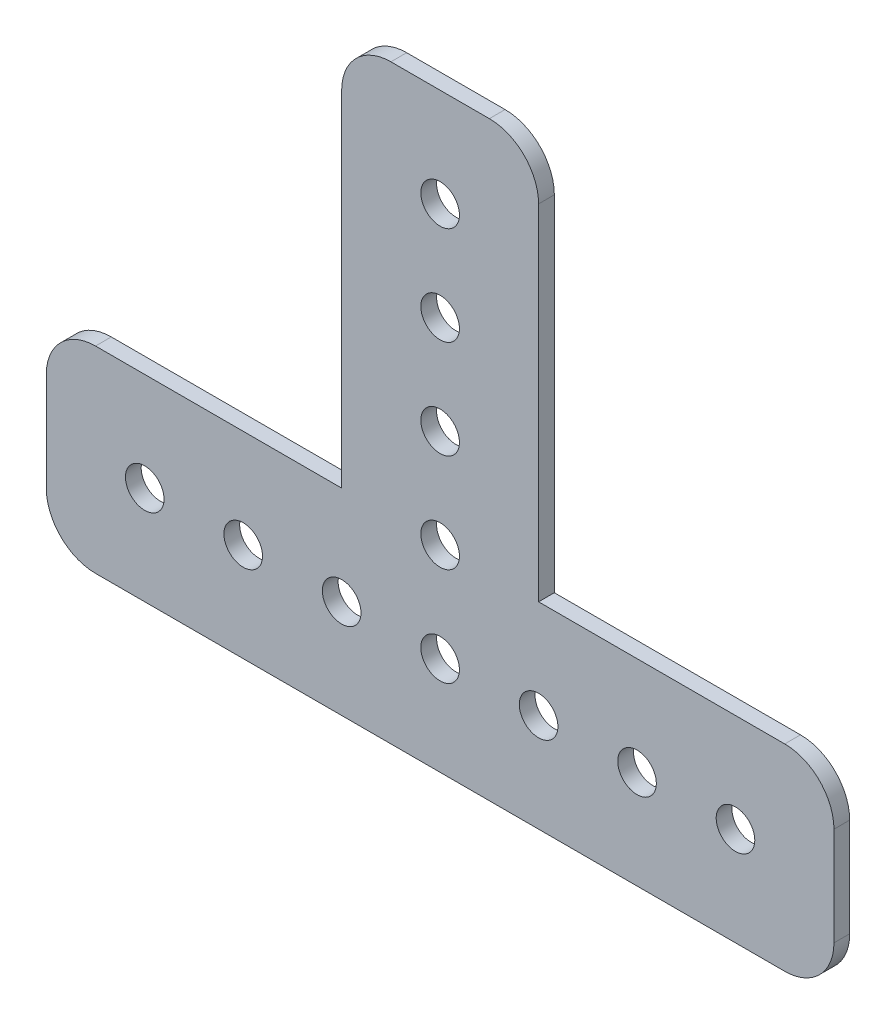
ISO-10303-21;
HEADER;
FILE_DESCRIPTION(('STEP AP214'),'2;1');
FILE_NAME('part.step','',(''),(''),'','','');
FILE_SCHEMA(('AUTOMOTIVE_DESIGN { 1 0 10303 214 1 1 1 1 }'));
ENDSEC;
DATA;
#1=APPLICATION_CONTEXT('core data for automotive mechanical design processes');
#2=APPLICATION_PROTOCOL_DEFINITION('international standard','automotive_design',2000,#1);
#3=PRODUCT_CONTEXT('',#1,'mechanical');
#4=PRODUCT('Part','Part','',(#3));
#5=PRODUCT_RELATED_PRODUCT_CATEGORY('part','',(#4));
#6=PRODUCT_DEFINITION_FORMATION('','',#4);
#7=PRODUCT_DEFINITION_CONTEXT('part definition',#1,'design');
#8=PRODUCT_DEFINITION('design','',#6,#7);
#9=PRODUCT_DEFINITION_SHAPE('','',#8);
#10=(LENGTH_UNIT() NAMED_UNIT(*) SI_UNIT(.MILLI.,.METRE.));
#11=(NAMED_UNIT(*) PLANE_ANGLE_UNIT() SI_UNIT($,.RADIAN.));
#12=(NAMED_UNIT(*) SI_UNIT($,.STERADIAN.) SOLID_ANGLE_UNIT());
#13=UNCERTAINTY_MEASURE_WITH_UNIT(LENGTH_MEASURE(1.E-05),#10,'distance_accuracy_value','');
#14=(GEOMETRIC_REPRESENTATION_CONTEXT(3) GLOBAL_UNCERTAINTY_ASSIGNED_CONTEXT((#13)) GLOBAL_UNIT_ASSIGNED_CONTEXT((#10,
#11,#12)) REPRESENTATION_CONTEXT('',''));
#15=CARTESIAN_POINT('',(0.,0.,0.));
#16=DIRECTION('',(0.,0.,1.));
#17=DIRECTION('',(1.,0.,0.));
#18=AXIS2_PLACEMENT_3D('',#15,#16,#17);
#19=CARTESIAN_POINT('',(50.8,27.2142857142857,0.));
#20=DIRECTION('',(0.,0.,1.));
#21=DIRECTION('',(1.,0.,0.));
#22=AXIS2_PLACEMENT_3D('',#19,#20,#21);
#23=PLANE('',#22);
#24=CARTESIAN_POINT('',(50.8,25.4,0.));
#25=DIRECTION('',(0.,0.,1.));
#26=DIRECTION('',(1.,0.,0.));
#27=AXIS2_PLACEMENT_3D('',#24,#25,#26);
#28=CIRCLE('',#27,2.4892);
#29=CARTESIAN_POINT('',(53.2892,25.4,0.));
#30=VERTEX_POINT('',#29);
#31=EDGE_CURVE('E222',#30,#30,#28,.T.);
#32=ORIENTED_EDGE('',*,*,#31,.T.);
#33=EDGE_LOOP('',(#32));
#34=FACE_BOUND('',#33,.T.);
#35=CARTESIAN_POINT('',(50.8,50.8,0.));
#36=DIRECTION('',(0.,0.,1.));
#37=DIRECTION('',(1.,0.,0.));
#38=AXIS2_PLACEMENT_3D('',#35,#36,#37);
#39=CIRCLE('',#38,2.4892);
#40=CARTESIAN_POINT('',(53.2892,50.8,0.));
#41=VERTEX_POINT('',#40);
#42=EDGE_CURVE('E225',#41,#41,#39,.T.);
#43=ORIENTED_EDGE('',*,*,#42,.T.);
#44=EDGE_LOOP('',(#43));
#45=FACE_BOUND('',#44,.T.);
#46=CARTESIAN_POINT('',(76.2,12.7,0.));
#47=DIRECTION('',(0.,0.,1.));
#48=DIRECTION('',(1.,0.,0.));
#49=AXIS2_PLACEMENT_3D('',#46,#47,#48);
#50=CIRCLE('',#49,2.4892);
#51=CARTESIAN_POINT('',(78.6892,12.7,0.));
#52=VERTEX_POINT('',#51);
#53=EDGE_CURVE('E228',#52,#52,#50,.T.);
#54=ORIENTED_EDGE('',*,*,#53,.T.);
#55=EDGE_LOOP('',(#54));
#56=FACE_BOUND('',#55,.T.);
#57=CARTESIAN_POINT('',(50.8,12.7,0.));
#58=DIRECTION('',(0.,0.,1.));
#59=DIRECTION('',(1.,0.,0.));
#60=AXIS2_PLACEMENT_3D('',#57,#58,#59);
#61=CIRCLE('',#60,2.4892);
#62=CARTESIAN_POINT('',(53.2892,12.7,0.));
#63=VERTEX_POINT('',#62);
#64=EDGE_CURVE('E231',#63,#63,#61,.T.);
#65=ORIENTED_EDGE('',*,*,#64,.T.);
#66=EDGE_LOOP('',(#65));
#67=FACE_BOUND('',#66,.T.);
#68=CARTESIAN_POINT('',(25.4,12.7,0.));
#69=DIRECTION('',(0.,0.,1.));
#70=DIRECTION('',(1.,0.,0.));
#71=AXIS2_PLACEMENT_3D('',#68,#69,#70);
#72=CIRCLE('',#71,2.4892);
#73=CARTESIAN_POINT('',(27.8892,12.7,0.));
#74=VERTEX_POINT('',#73);
#75=EDGE_CURVE('E234',#74,#74,#72,.T.);
#76=ORIENTED_EDGE('',*,*,#75,.T.);
#77=EDGE_LOOP('',(#76));
#78=FACE_BOUND('',#77,.T.);
#79=CARTESIAN_POINT('',(12.7,12.7,0.));
#80=DIRECTION('',(0.,0.,1.));
#81=DIRECTION('',(1.,0.,0.));
#82=AXIS2_PLACEMENT_3D('',#79,#80,#81);
#83=CIRCLE('',#82,2.4892);
#84=CARTESIAN_POINT('',(15.1892,12.7,0.));
#85=VERTEX_POINT('',#84);
#86=EDGE_CURVE('E237',#85,#85,#83,.T.);
#87=ORIENTED_EDGE('',*,*,#86,.T.);
#88=EDGE_LOOP('',(#87));
#89=FACE_BOUND('',#88,.T.);
#90=CARTESIAN_POINT('',(50.8,63.5,0.));
#91=DIRECTION('',(0.,0.,1.));
#92=DIRECTION('',(1.,0.,0.));
#93=AXIS2_PLACEMENT_3D('',#90,#91,#92);
#94=CIRCLE('',#93,2.4892);
#95=CARTESIAN_POINT('',(53.2892,63.5,0.));
#96=VERTEX_POINT('',#95);
#97=EDGE_CURVE('E240',#96,#96,#94,.T.);
#98=ORIENTED_EDGE('',*,*,#97,.T.);
#99=EDGE_LOOP('',(#98));
#100=FACE_BOUND('',#99,.T.);
#101=CARTESIAN_POINT('',(38.1,12.7,0.));
#102=DIRECTION('',(0.,0.,1.));
#103=DIRECTION('',(1.,0.,0.));
#104=AXIS2_PLACEMENT_3D('',#101,#102,#103);
#105=CIRCLE('',#104,2.4892);
#106=CARTESIAN_POINT('',(40.5892,12.7,0.));
#107=VERTEX_POINT('',#106);
#108=EDGE_CURVE('E243',#107,#107,#105,.T.);
#109=ORIENTED_EDGE('',*,*,#108,.T.);
#110=EDGE_LOOP('',(#109));
#111=FACE_BOUND('',#110,.T.);
#112=CARTESIAN_POINT('',(63.5,12.7,0.));
#113=DIRECTION('',(0.,0.,1.));
#114=DIRECTION('',(1.,0.,0.));
#115=AXIS2_PLACEMENT_3D('',#112,#113,#114);
#116=CIRCLE('',#115,2.4892);
#117=CARTESIAN_POINT('',(65.9892,12.7,0.));
#118=VERTEX_POINT('',#117);
#119=EDGE_CURVE('E246',#118,#118,#116,.T.);
#120=ORIENTED_EDGE('',*,*,#119,.T.);
#121=EDGE_LOOP('',(#120));
#122=FACE_BOUND('',#121,.T.);
#123=CARTESIAN_POINT('',(88.9,12.7,0.));
#124=DIRECTION('',(0.,0.,1.));
#125=DIRECTION('',(1.,0.,0.));
#126=AXIS2_PLACEMENT_3D('',#123,#124,#125);
#127=CIRCLE('',#126,2.4892);
#128=CARTESIAN_POINT('',(91.3892,12.7,0.));
#129=VERTEX_POINT('',#128);
#130=EDGE_CURVE('E129',#129,#129,#127,.T.);
#131=ORIENTED_EDGE('',*,*,#130,.T.);
#132=EDGE_LOOP('',(#131));
#133=FACE_BOUND('',#132,.T.);
#134=CARTESIAN_POINT('',(50.8,38.1,0.));
#135=DIRECTION('',(0.,0.,1.));
#136=DIRECTION('',(1.,0.,0.));
#137=AXIS2_PLACEMENT_3D('',#134,#135,#136);
#138=CIRCLE('',#137,2.4892);
#139=CARTESIAN_POINT('',(53.2892,38.1,0.));
#140=VERTEX_POINT('',#139);
#141=EDGE_CURVE('E126',#140,#140,#138,.T.);
#142=ORIENTED_EDGE('',*,*,#141,.T.);
#143=EDGE_LOOP('',(#142));
#144=FACE_BOUND('',#143,.T.);
#145=DIRECTION('',(1.,0.,0.));
#146=VECTOR('',#145,1.);
#147=CARTESIAN_POINT('',(0.,0.,0.));
#148=LINE('',#147,#146);
#149=CARTESIAN_POINT('',(6.35,0.,0.));
#150=VERTEX_POINT('',#149);
#151=CARTESIAN_POINT('',(95.25,0.,0.));
#152=VERTEX_POINT('',#151);
#153=EDGE_CURVE('E110',#150,#152,#148,.T.);
#154=ORIENTED_EDGE('',*,*,#153,.F.);
#155=CARTESIAN_POINT('',(6.35,6.35,0.));
#156=DIRECTION('',(0.,0.,1.));
#157=DIRECTION('',(1.,0.,0.));
#158=AXIS2_PLACEMENT_3D('',#155,#156,#157);
#159=CIRCLE('',#158,6.35);
#160=CARTESIAN_POINT('',(0.,6.35,0.));
#161=VERTEX_POINT('',#160);
#162=EDGE_CURVE('E123',#161,#150,#159,.T.);
#163=ORIENTED_EDGE('',*,*,#162,.F.);
#164=DIRECTION('',(0.,1.,0.));
#165=VECTOR('',#164,1.);
#166=CARTESIAN_POINT('',(0.,25.4,0.));
#167=LINE('',#166,#165);
#168=CARTESIAN_POINT('',(0.,19.05,0.));
#169=VERTEX_POINT('',#168);
#170=EDGE_CURVE('E135',#169,#161,#167,.F.);
#171=ORIENTED_EDGE('',*,*,#170,.F.);
#172=CARTESIAN_POINT('',(6.35,19.05,0.));
#173=DIRECTION('',(0.,0.,1.));
#174=DIRECTION('',(1.,0.,0.));
#175=AXIS2_PLACEMENT_3D('',#172,#173,#174);
#176=CIRCLE('',#175,6.35);
#177=CARTESIAN_POINT('',(6.35,25.4,0.));
#178=VERTEX_POINT('',#177);
#179=EDGE_CURVE('E252',#178,#169,#176,.T.);
#180=ORIENTED_EDGE('',*,*,#179,.F.);
#181=DIRECTION('',(1.,0.,0.));
#182=VECTOR('',#181,1.);
#183=CARTESIAN_POINT('',(38.1,25.4,0.));
#184=LINE('',#183,#182);
#185=CARTESIAN_POINT('',(38.1,25.4,0.));
#186=VERTEX_POINT('',#185);
#187=EDGE_CURVE('E139',#186,#178,#184,.F.);
#188=ORIENTED_EDGE('',*,*,#187,.F.);
#189=DIRECTION('',(0.,-1.,0.));
#190=VECTOR('',#189,1.);
#191=CARTESIAN_POINT('',(38.1,76.2,0.));
#192=LINE('',#191,#190);
#193=CARTESIAN_POINT('',(38.1,69.85,0.));
#194=VERTEX_POINT('',#193);
#195=EDGE_CURVE('E145',#194,#186,#192,.T.);
#196=ORIENTED_EDGE('',*,*,#195,.F.);
#197=CARTESIAN_POINT('',(44.45,69.85,0.));
#198=DIRECTION('',(0.,0.,1.));
#199=DIRECTION('',(1.,0.,0.));
#200=AXIS2_PLACEMENT_3D('',#197,#198,#199);
#201=CIRCLE('',#200,6.35);
#202=CARTESIAN_POINT('',(44.45,76.2,0.));
#203=VERTEX_POINT('',#202);
#204=EDGE_CURVE('E254',#203,#194,#201,.T.);
#205=ORIENTED_EDGE('',*,*,#204,.F.);
#206=DIRECTION('',(1.,0.,0.));
#207=VECTOR('',#206,1.);
#208=CARTESIAN_POINT('',(63.5,76.2,0.));
#209=LINE('',#208,#207);
#210=CARTESIAN_POINT('',(57.15,76.2,0.));
#211=VERTEX_POINT('',#210);
#212=EDGE_CURVE('E151',#211,#203,#209,.F.);
#213=ORIENTED_EDGE('',*,*,#212,.F.);
#214=CARTESIAN_POINT('',(57.15,69.85,0.));
#215=DIRECTION('',(0.,0.,1.));
#216=DIRECTION('',(1.,0.,0.));
#217=AXIS2_PLACEMENT_3D('',#214,#215,#216);
#218=CIRCLE('',#217,6.35);
#219=CARTESIAN_POINT('',(63.5,69.85,0.));
#220=VERTEX_POINT('',#219);
#221=EDGE_CURVE('E256',#220,#211,#218,.T.);
#222=ORIENTED_EDGE('',*,*,#221,.F.);
#223=DIRECTION('',(0.,1.,0.));
#224=VECTOR('',#223,1.);
#225=CARTESIAN_POINT('',(63.5,25.4,0.));
#226=LINE('',#225,#224);
#227=CARTESIAN_POINT('',(63.5,25.4,0.));
#228=VERTEX_POINT('',#227);
#229=EDGE_CURVE('E155',#228,#220,#226,.T.);
#230=ORIENTED_EDGE('',*,*,#229,.F.);
#231=DIRECTION('',(-1.,0.,0.));
#232=VECTOR('',#231,1.);
#233=CARTESIAN_POINT('',(101.6,25.4,0.));
#234=LINE('',#233,#232);
#235=CARTESIAN_POINT('',(95.25,25.4,0.));
#236=VERTEX_POINT('',#235);
#237=EDGE_CURVE('E161',#236,#228,#234,.T.);
#238=ORIENTED_EDGE('',*,*,#237,.F.);
#239=CARTESIAN_POINT('',(95.25,19.05,0.));
#240=DIRECTION('',(0.,0.,1.));
#241=DIRECTION('',(1.,0.,0.));
#242=AXIS2_PLACEMENT_3D('',#239,#240,#241);
#243=CIRCLE('',#242,6.35);
#244=CARTESIAN_POINT('',(101.6,19.05,0.));
#245=VERTEX_POINT('',#244);
#246=EDGE_CURVE('E257',#245,#236,#243,.T.);
#247=ORIENTED_EDGE('',*,*,#246,.F.);
#248=DIRECTION('',(0.,1.,0.));
#249=VECTOR('',#248,1.);
#250=CARTESIAN_POINT('',(101.6,0.,0.));
#251=LINE('',#250,#249);
#252=CARTESIAN_POINT('',(101.6,6.35,0.));
#253=VERTEX_POINT('',#252);
#254=EDGE_CURVE('E112',#253,#245,#251,.T.);
#255=ORIENTED_EDGE('',*,*,#254,.F.);
#256=CARTESIAN_POINT('',(95.25,6.35,0.));
#257=DIRECTION('',(0.,0.,1.));
#258=DIRECTION('',(1.,0.,0.));
#259=AXIS2_PLACEMENT_3D('',#256,#257,#258);
#260=CIRCLE('',#259,6.35);
#261=EDGE_CURVE('E18',#152,#253,#260,.T.);
#262=ORIENTED_EDGE('',*,*,#261,.F.);
#263=EDGE_LOOP('',(#154,#163,#171,#180,#188,#196,#205,#213,#222,#230,#238,#247,#255,#262));
#264=FACE_BOUND('',#263,.T.);
#265=ADVANCED_FACE('F15',(#34,#45,#56,#67,#78,#89,#100,#111,#122,#133,#144,#264),#23,.F.);
#266=CARTESIAN_POINT('',(95.25,6.35,0.));
#267=DIRECTION('',(0.,0.,1.));
#268=DIRECTION('',(1.,0.,0.));
#269=AXIS2_PLACEMENT_3D('',#266,#267,#268);
#270=CYLINDRICAL_SURFACE('',#269,6.35);
#271=ORIENTED_EDGE('',*,*,#261,.T.);
#272=DIRECTION('',(0.,0.,-1.));
#273=VECTOR('',#272,1.);
#274=CARTESIAN_POINT('',(101.6,6.35,0.));
#275=LINE('',#274,#273);
#276=CARTESIAN_POINT('',(101.6,6.35,2.032));
#277=VERTEX_POINT('',#276);
#278=EDGE_CURVE('E115',#277,#253,#275,.T.);
#279=ORIENTED_EDGE('',*,*,#278,.F.);
#280=CARTESIAN_POINT('',(95.25,6.35,2.032));
#281=DIRECTION('',(0.,0.,1.));
#282=DIRECTION('',(1.,0.,0.));
#283=AXIS2_PLACEMENT_3D('',#280,#281,#282);
#284=CIRCLE('',#283,6.35);
#285=CARTESIAN_POINT('',(95.25,0.,2.032));
#286=VERTEX_POINT('',#285);
#287=EDGE_CURVE('E120',#286,#277,#284,.T.);
#288=ORIENTED_EDGE('',*,*,#287,.F.);
#289=DIRECTION('',(0.,0.,1.));
#290=VECTOR('',#289,1.);
#291=CARTESIAN_POINT('',(95.25,0.,0.));
#292=LINE('',#291,#290);
#293=EDGE_CURVE('E117',#152,#286,#292,.T.);
#294=ORIENTED_EDGE('',*,*,#293,.F.);
#295=EDGE_LOOP('',(#271,#279,#288,#294));
#296=FACE_BOUND('',#295,.T.);
#297=ADVANCED_FACE('F118',(#296),#270,.T.);
#298=CARTESIAN_POINT('',(101.6,0.,0.));
#299=DIRECTION('',(1.,0.,0.));
#300=DIRECTION('',(0.,0.,-1.));
#301=AXIS2_PLACEMENT_3D('',#298,#299,#300);
#302=PLANE('',#301);
#303=DIRECTION('',(0.,0.,1.));
#304=VECTOR('',#303,1.);
#305=CARTESIAN_POINT('',(101.6,19.05,0.));
#306=LINE('',#305,#304);
#307=CARTESIAN_POINT('',(101.6,19.05,2.032));
#308=VERTEX_POINT('',#307);
#309=EDGE_CURVE('E167',#308,#245,#306,.F.);
#310=ORIENTED_EDGE('',*,*,#309,.F.);
#311=DIRECTION('',(0.,1.,0.));
#312=VECTOR('',#311,1.);
#313=CARTESIAN_POINT('',(101.6,27.2142857142857,2.032));
#314=LINE('',#313,#312);
#315=EDGE_CURVE('E220',#277,#308,#314,.T.);
#316=ORIENTED_EDGE('',*,*,#315,.F.);
#317=ORIENTED_EDGE('',*,*,#278,.T.);
#318=ORIENTED_EDGE('',*,*,#254,.T.);
#319=EDGE_LOOP('',(#310,#316,#317,#318));
#320=FACE_BOUND('',#319,.T.);
#321=ADVANCED_FACE('F346',(#320),#302,.T.);
#322=CARTESIAN_POINT('',(95.25,19.05,0.));
#323=DIRECTION('',(0.,0.,1.));
#324=DIRECTION('',(1.,0.,0.));
#325=AXIS2_PLACEMENT_3D('',#322,#323,#324);
#326=CYLINDRICAL_SURFACE('',#325,6.35);
#327=ORIENTED_EDGE('',*,*,#246,.T.);
#328=DIRECTION('',(0.,0.,1.));
#329=VECTOR('',#328,1.);
#330=CARTESIAN_POINT('',(95.25,25.4,0.));
#331=LINE('',#330,#329);
#332=CARTESIAN_POINT('',(95.25,25.4,2.032));
#333=VERTEX_POINT('',#332);
#334=EDGE_CURVE('E164',#333,#236,#331,.F.);
#335=ORIENTED_EDGE('',*,*,#334,.F.);
#336=CARTESIAN_POINT('',(95.25,19.05,2.032));
#337=DIRECTION('',(0.,0.,1.));
#338=DIRECTION('',(1.,0.,0.));
#339=AXIS2_PLACEMENT_3D('',#336,#337,#338);
#340=CIRCLE('',#339,6.35);
#341=EDGE_CURVE('E216',#308,#333,#340,.T.);
#342=ORIENTED_EDGE('',*,*,#341,.F.);
#343=ORIENTED_EDGE('',*,*,#309,.T.);
#344=EDGE_LOOP('',(#327,#335,#342,#343));
#345=FACE_BOUND('',#344,.T.);
#346=ADVANCED_FACE('F344',(#345),#326,.T.);
#347=CARTESIAN_POINT('',(101.6,25.4,0.));
#348=DIRECTION('',(0.,1.,0.));
#349=DIRECTION('',(-1.,0.,0.));
#350=AXIS2_PLACEMENT_3D('',#347,#348,#349);
#351=PLANE('',#350);
#352=DIRECTION('',(0.,0.,-1.));
#353=VECTOR('',#352,1.);
#354=CARTESIAN_POINT('',(63.5,25.4,0.));
#355=LINE('',#354,#353);
#356=CARTESIAN_POINT('',(63.5,25.4,2.032));
#357=VERTEX_POINT('',#356);
#358=EDGE_CURVE('E158',#357,#228,#355,.T.);
#359=ORIENTED_EDGE('',*,*,#358,.F.);
#360=DIRECTION('',(1.,0.,0.));
#361=VECTOR('',#360,1.);
#362=CARTESIAN_POINT('',(50.8,25.4,2.032));
#363=LINE('',#362,#361);
#364=EDGE_CURVE('E219',#333,#357,#363,.F.);
#365=ORIENTED_EDGE('',*,*,#364,.F.);
#366=ORIENTED_EDGE('',*,*,#334,.T.);
#367=ORIENTED_EDGE('',*,*,#237,.T.);
#368=EDGE_LOOP('',(#359,#365,#366,#367));
#369=FACE_BOUND('',#368,.T.);
#370=ADVANCED_FACE('F335',(#369),#351,.T.);
#371=CARTESIAN_POINT('',(63.5,25.4,0.));
#372=DIRECTION('',(1.,0.,0.));
#373=DIRECTION('',(0.,0.,-1.));
#374=AXIS2_PLACEMENT_3D('',#371,#372,#373);
#375=PLANE('',#374);
#376=ORIENTED_EDGE('',*,*,#358,.T.);
#377=ORIENTED_EDGE('',*,*,#229,.T.);
#378=DIRECTION('',(0.,0.,1.));
#379=VECTOR('',#378,1.);
#380=CARTESIAN_POINT('',(63.5,69.85,0.));
#381=LINE('',#380,#379);
#382=CARTESIAN_POINT('',(63.5,69.85,2.032));
#383=VERTEX_POINT('',#382);
#384=EDGE_CURVE('E157',#383,#220,#381,.F.);
#385=ORIENTED_EDGE('',*,*,#384,.F.);
#386=DIRECTION('',(0.,1.,0.));
#387=VECTOR('',#386,1.);
#388=CARTESIAN_POINT('',(63.5,27.2142857142857,2.032));
#389=LINE('',#388,#387);
#390=EDGE_CURVE('E215',#357,#383,#389,.T.);
#391=ORIENTED_EDGE('',*,*,#390,.F.);
#392=EDGE_LOOP('',(#376,#377,#385,#391));
#393=FACE_BOUND('',#392,.T.);
#394=ADVANCED_FACE('F341',(#393),#375,.T.);
#395=CARTESIAN_POINT('',(57.15,69.85,0.));
#396=DIRECTION('',(0.,0.,1.));
#397=DIRECTION('',(1.,0.,0.));
#398=AXIS2_PLACEMENT_3D('',#395,#396,#397);
#399=CYLINDRICAL_SURFACE('',#398,6.35);
#400=ORIENTED_EDGE('',*,*,#221,.T.);
#401=DIRECTION('',(0.,0.,1.));
#402=VECTOR('',#401,1.);
#403=CARTESIAN_POINT('',(57.15,76.2,0.));
#404=LINE('',#403,#402);
#405=CARTESIAN_POINT('',(57.15,76.2,2.032));
#406=VERTEX_POINT('',#405);
#407=EDGE_CURVE('E154',#406,#211,#404,.F.);
#408=ORIENTED_EDGE('',*,*,#407,.F.);
#409=CARTESIAN_POINT('',(57.15,69.85,2.032));
#410=DIRECTION('',(0.,0.,1.));
#411=DIRECTION('',(1.,0.,0.));
#412=AXIS2_PLACEMENT_3D('',#409,#410,#411);
#413=CIRCLE('',#412,6.35);
#414=EDGE_CURVE('E212',#383,#406,#413,.T.);
#415=ORIENTED_EDGE('',*,*,#414,.F.);
#416=ORIENTED_EDGE('',*,*,#384,.T.);
#417=EDGE_LOOP('',(#400,#408,#415,#416));
#418=FACE_BOUND('',#417,.T.);
#419=ADVANCED_FACE('F426',(#418),#399,.T.);
#420=CARTESIAN_POINT('',(63.5,76.2,0.));
#421=DIRECTION('',(0.,1.,0.));
#422=DIRECTION('',(0.,0.,1.));
#423=AXIS2_PLACEMENT_3D('',#420,#421,#422);
#424=PLANE('',#423);
#425=DIRECTION('',(0.,0.,1.));
#426=VECTOR('',#425,1.);
#427=CARTESIAN_POINT('',(44.45,76.2,0.));
#428=LINE('',#427,#426);
#429=CARTESIAN_POINT('',(44.45,76.2,2.032));
#430=VERTEX_POINT('',#429);
#431=EDGE_CURVE('E153',#430,#203,#428,.F.);
#432=ORIENTED_EDGE('',*,*,#431,.F.);
#433=DIRECTION('',(1.,0.,0.));
#434=VECTOR('',#433,1.);
#435=CARTESIAN_POINT('',(50.8,76.2,2.032));
#436=LINE('',#435,#434);
#437=EDGE_CURVE('E211',#406,#430,#436,.F.);
#438=ORIENTED_EDGE('',*,*,#437,.F.);
#439=ORIENTED_EDGE('',*,*,#407,.T.);
#440=ORIENTED_EDGE('',*,*,#212,.T.);
#441=EDGE_LOOP('',(#432,#438,#439,#440));
#442=FACE_BOUND('',#441,.T.);
#443=ADVANCED_FACE('F422',(#442),#424,.T.);
#444=CARTESIAN_POINT('',(44.45,69.85,0.));
#445=DIRECTION('',(0.,0.,1.));
#446=DIRECTION('',(1.,0.,0.));
#447=AXIS2_PLACEMENT_3D('',#444,#445,#446);
#448=CYLINDRICAL_SURFACE('',#447,6.35);
#449=ORIENTED_EDGE('',*,*,#204,.T.);
#450=DIRECTION('',(0.,0.,1.));
#451=VECTOR('',#450,1.);
#452=CARTESIAN_POINT('',(38.1,69.85,0.));
#453=LINE('',#452,#451);
#454=CARTESIAN_POINT('',(38.1,69.85,2.032));
#455=VERTEX_POINT('',#454);
#456=EDGE_CURVE('E148',#455,#194,#453,.F.);
#457=ORIENTED_EDGE('',*,*,#456,.F.);
#458=CARTESIAN_POINT('',(44.45,69.85,2.032));
#459=DIRECTION('',(0.,0.,1.));
#460=DIRECTION('',(1.,0.,0.));
#461=AXIS2_PLACEMENT_3D('',#458,#459,#460);
#462=CIRCLE('',#461,6.35);
#463=EDGE_CURVE('E207',#430,#455,#462,.T.);
#464=ORIENTED_EDGE('',*,*,#463,.F.);
#465=ORIENTED_EDGE('',*,*,#431,.T.);
#466=EDGE_LOOP('',(#449,#457,#464,#465));
#467=FACE_BOUND('',#466,.T.);
#468=ADVANCED_FACE('F419',(#467),#448,.T.);
#469=CARTESIAN_POINT('',(38.1,76.2,0.));
#470=DIRECTION('',(-1.,0.,0.));
#471=DIRECTION('',(0.,-1.,0.));
#472=AXIS2_PLACEMENT_3D('',#469,#470,#471);
#473=PLANE('',#472);
#474=DIRECTION('',(0.,0.,1.));
#475=VECTOR('',#474,1.);
#476=CARTESIAN_POINT('',(38.1,25.4,0.));
#477=LINE('',#476,#475);
#478=CARTESIAN_POINT('',(38.1,25.4,2.032));
#479=VERTEX_POINT('',#478);
#480=EDGE_CURVE('E142',#479,#186,#477,.F.);
#481=ORIENTED_EDGE('',*,*,#480,.F.);
#482=DIRECTION('',(0.,1.,0.));
#483=VECTOR('',#482,1.);
#484=CARTESIAN_POINT('',(38.1,27.2142857142857,2.032));
#485=LINE('',#484,#483);
#486=EDGE_CURVE('E210',#455,#479,#485,.F.);
#487=ORIENTED_EDGE('',*,*,#486,.F.);
#488=ORIENTED_EDGE('',*,*,#456,.T.);
#489=ORIENTED_EDGE('',*,*,#195,.T.);
#490=EDGE_LOOP('',(#481,#487,#488,#489));
#491=FACE_BOUND('',#490,.T.);
#492=ADVANCED_FACE('F329',(#491),#473,.T.);
#493=CARTESIAN_POINT('',(38.1,25.4,0.));
#494=DIRECTION('',(0.,1.,0.));
#495=DIRECTION('',(0.,0.,1.));
#496=AXIS2_PLACEMENT_3D('',#493,#494,#495);
#497=PLANE('',#496);
#498=ORIENTED_EDGE('',*,*,#480,.T.);
#499=ORIENTED_EDGE('',*,*,#187,.T.);
#500=DIRECTION('',(0.,0.,1.));
#501=VECTOR('',#500,1.);
#502=CARTESIAN_POINT('',(6.35,25.4,0.));
#503=LINE('',#502,#501);
#504=CARTESIAN_POINT('',(6.35,25.4,2.032));
#505=VERTEX_POINT('',#504);
#506=EDGE_CURVE('E141',#505,#178,#503,.F.);
#507=ORIENTED_EDGE('',*,*,#506,.F.);
#508=DIRECTION('',(1.,0.,0.));
#509=VECTOR('',#508,1.);
#510=CARTESIAN_POINT('',(50.8,25.4,2.032));
#511=LINE('',#510,#509);
#512=EDGE_CURVE('E206',#479,#505,#511,.F.);
#513=ORIENTED_EDGE('',*,*,#512,.F.);
#514=EDGE_LOOP('',(#498,#499,#507,#513));
#515=FACE_BOUND('',#514,.T.);
#516=ADVANCED_FACE('F324',(#515),#497,.T.);
#517=CARTESIAN_POINT('',(6.35,19.05,0.));
#518=DIRECTION('',(0.,0.,1.));
#519=DIRECTION('',(1.,0.,0.));
#520=AXIS2_PLACEMENT_3D('',#517,#518,#519);
#521=CYLINDRICAL_SURFACE('',#520,6.35);
#522=ORIENTED_EDGE('',*,*,#179,.T.);
#523=DIRECTION('',(0.,0.,1.));
#524=VECTOR('',#523,1.);
#525=CARTESIAN_POINT('',(0.,19.05,0.));
#526=LINE('',#525,#524);
#527=CARTESIAN_POINT('',(0.,19.05,2.032));
#528=VERTEX_POINT('',#527);
#529=EDGE_CURVE('E138',#528,#169,#526,.F.);
#530=ORIENTED_EDGE('',*,*,#529,.F.);
#531=CARTESIAN_POINT('',(6.35,19.05,2.032));
#532=DIRECTION('',(0.,0.,1.));
#533=DIRECTION('',(1.,0.,0.));
#534=AXIS2_PLACEMENT_3D('',#531,#532,#533);
#535=CIRCLE('',#534,6.35);
#536=EDGE_CURVE('E203',#505,#528,#535,.T.);
#537=ORIENTED_EDGE('',*,*,#536,.F.);
#538=ORIENTED_EDGE('',*,*,#506,.T.);
#539=EDGE_LOOP('',(#522,#530,#537,#538));
#540=FACE_BOUND('',#539,.T.);
#541=ADVANCED_FACE('F321',(#540),#521,.T.);
#542=CARTESIAN_POINT('',(0.,25.4,0.));
#543=DIRECTION('',(-1.,0.,0.));
#544=DIRECTION('',(0.,0.,1.));
#545=AXIS2_PLACEMENT_3D('',#542,#543,#544);
#546=PLANE('',#545);
#547=ORIENTED_EDGE('',*,*,#529,.T.);
#548=ORIENTED_EDGE('',*,*,#170,.T.);
#549=DIRECTION('',(0.,0.,1.));
#550=VECTOR('',#549,1.);
#551=CARTESIAN_POINT('',(0.,6.35,0.));
#552=LINE('',#551,#550);
#553=CARTESIAN_POINT('',(0.,6.35,2.032));
#554=VERTEX_POINT('',#553);
#555=EDGE_CURVE('E137',#554,#161,#552,.F.);
#556=ORIENTED_EDGE('',*,*,#555,.F.);
#557=DIRECTION('',(0.,1.,0.));
#558=VECTOR('',#557,1.);
#559=CARTESIAN_POINT('',(0.,27.2142857142857,2.032));
#560=LINE('',#559,#558);
#561=EDGE_CURVE('E202',#528,#554,#560,.F.);
#562=ORIENTED_EDGE('',*,*,#561,.F.);
#563=EDGE_LOOP('',(#547,#548,#556,#562));
#564=FACE_BOUND('',#563,.T.);
#565=ADVANCED_FACE('F314',(#564),#546,.T.);
#566=CARTESIAN_POINT('',(6.35,6.35,0.));
#567=DIRECTION('',(0.,0.,1.));
#568=DIRECTION('',(1.,0.,0.));
#569=AXIS2_PLACEMENT_3D('',#566,#567,#568);
#570=CYLINDRICAL_SURFACE('',#569,6.35);
#571=ORIENTED_EDGE('',*,*,#162,.T.);
#572=DIRECTION('',(0.,0.,1.));
#573=VECTOR('',#572,1.);
#574=CARTESIAN_POINT('',(6.35,0.,0.));
#575=LINE('',#574,#573);
#576=CARTESIAN_POINT('',(6.35,0.,2.032));
#577=VERTEX_POINT('',#576);
#578=EDGE_CURVE('E33',#577,#150,#575,.F.);
#579=ORIENTED_EDGE('',*,*,#578,.F.);
#580=CARTESIAN_POINT('',(6.35,6.35,2.032));
#581=DIRECTION('',(0.,0.,1.));
#582=DIRECTION('',(1.,0.,0.));
#583=AXIS2_PLACEMENT_3D('',#580,#581,#582);
#584=CIRCLE('',#583,6.35);
#585=EDGE_CURVE('E199',#554,#577,#584,.T.);
#586=ORIENTED_EDGE('',*,*,#585,.F.);
#587=ORIENTED_EDGE('',*,*,#555,.T.);
#588=EDGE_LOOP('',(#571,#579,#586,#587));
#589=FACE_BOUND('',#588,.T.);
#590=ADVANCED_FACE('F312',(#589),#570,.T.);
#591=CARTESIAN_POINT('',(0.,0.,0.));
#592=DIRECTION('',(0.,-1.,0.));
#593=DIRECTION('',(1.,0.,0.));
#594=AXIS2_PLACEMENT_3D('',#591,#592,#593);
#595=PLANE('',#594);
#596=ORIENTED_EDGE('',*,*,#578,.T.);
#597=ORIENTED_EDGE('',*,*,#153,.T.);
#598=ORIENTED_EDGE('',*,*,#293,.T.);
#599=DIRECTION('',(1.,0.,0.));
#600=VECTOR('',#599,1.);
#601=CARTESIAN_POINT('',(50.8,0.,2.032));
#602=LINE('',#601,#600);
#603=EDGE_CURVE('E198',#577,#286,#602,.T.);
#604=ORIENTED_EDGE('',*,*,#603,.F.);
#605=EDGE_LOOP('',(#596,#597,#598,#604));
#606=FACE_BOUND('',#605,.T.);
#607=ADVANCED_FACE('F125',(#606),#595,.T.);
#608=CARTESIAN_POINT('',(50.8,38.1,-124.984254959749));
#609=DIRECTION('',(0.,0.,1.));
#610=DIRECTION('',(1.,0.,0.));
#611=AXIS2_PLACEMENT_3D('',#608,#609,#610);
#612=CYLINDRICAL_SURFACE('',#611,2.4892);
#613=CARTESIAN_POINT('',(50.8,38.1,2.03199999999999));
#614=DIRECTION('',(0.,0.,1.));
#615=DIRECTION('',(1.,0.,0.));
#616=AXIS2_PLACEMENT_3D('',#613,#614,#615);
#617=CIRCLE('',#616,2.4892);
#618=CARTESIAN_POINT('',(53.2892,38.1,2.03199999999999));
#619=VERTEX_POINT('',#618);
#620=EDGE_CURVE('E195',#619,#619,#617,.F.);
#621=ORIENTED_EDGE('',*,*,#620,.F.);
#622=EDGE_LOOP('',(#621));
#623=FACE_BOUND('',#622,.T.);
#624=ORIENTED_EDGE('',*,*,#141,.F.);
#625=EDGE_LOOP('',(#624));
#626=FACE_BOUND('',#625,.T.);
#627=ADVANCED_FACE('F402',(#623,#626),#612,.F.);
#628=CARTESIAN_POINT('',(88.9,12.7,-124.984254959749));
#629=DIRECTION('',(0.,0.,1.));
#630=DIRECTION('',(1.,0.,0.));
#631=AXIS2_PLACEMENT_3D('',#628,#629,#630);
#632=CYLINDRICAL_SURFACE('',#631,2.4892);
#633=CARTESIAN_POINT('',(88.9,12.7,2.03199999999999));
#634=DIRECTION('',(0.,0.,1.));
#635=DIRECTION('',(1.,0.,0.));
#636=AXIS2_PLACEMENT_3D('',#633,#634,#635);
#637=CIRCLE('',#636,2.4892);
#638=CARTESIAN_POINT('',(91.3892,12.7,2.03199999999999));
#639=VERTEX_POINT('',#638);
#640=EDGE_CURVE('E192',#639,#639,#637,.F.);
#641=ORIENTED_EDGE('',*,*,#640,.F.);
#642=EDGE_LOOP('',(#641));
#643=FACE_BOUND('',#642,.T.);
#644=ORIENTED_EDGE('',*,*,#130,.F.);
#645=EDGE_LOOP('',(#644));
#646=FACE_BOUND('',#645,.T.);
#647=ADVANCED_FACE('F398',(#643,#646),#632,.F.);
#648=CARTESIAN_POINT('',(63.5,12.7,-124.984254959749));
#649=DIRECTION('',(0.,0.,1.));
#650=DIRECTION('',(1.,0.,0.));
#651=AXIS2_PLACEMENT_3D('',#648,#649,#650);
#652=CYLINDRICAL_SURFACE('',#651,2.4892);
#653=CARTESIAN_POINT('',(63.5,12.7,2.03199999999999));
#654=DIRECTION('',(0.,0.,1.));
#655=DIRECTION('',(1.,0.,0.));
#656=AXIS2_PLACEMENT_3D('',#653,#654,#655);
#657=CIRCLE('',#656,2.4892);
#658=CARTESIAN_POINT('',(65.9892,12.7,2.03199999999999));
#659=VERTEX_POINT('',#658);
#660=EDGE_CURVE('E189',#659,#659,#657,.F.);
#661=ORIENTED_EDGE('',*,*,#660,.F.);
#662=EDGE_LOOP('',(#661));
#663=FACE_BOUND('',#662,.T.);
#664=ORIENTED_EDGE('',*,*,#119,.F.);
#665=EDGE_LOOP('',(#664));
#666=FACE_BOUND('',#665,.T.);
#667=ADVANCED_FACE('F394',(#663,#666),#652,.F.);
#668=CARTESIAN_POINT('',(38.1,12.7,-124.984254959749));
#669=DIRECTION('',(0.,0.,1.));
#670=DIRECTION('',(1.,0.,0.));
#671=AXIS2_PLACEMENT_3D('',#668,#669,#670);
#672=CYLINDRICAL_SURFACE('',#671,2.4892);
#673=CARTESIAN_POINT('',(38.1,12.7,2.03199999999999));
#674=DIRECTION('',(0.,0.,1.));
#675=DIRECTION('',(1.,0.,0.));
#676=AXIS2_PLACEMENT_3D('',#673,#674,#675);
#677=CIRCLE('',#676,2.4892);
#678=CARTESIAN_POINT('',(40.5892,12.7,2.03199999999999));
#679=VERTEX_POINT('',#678);
#680=EDGE_CURVE('E186',#679,#679,#677,.F.);
#681=ORIENTED_EDGE('',*,*,#680,.F.);
#682=EDGE_LOOP('',(#681));
#683=FACE_BOUND('',#682,.T.);
#684=ORIENTED_EDGE('',*,*,#108,.F.);
#685=EDGE_LOOP('',(#684));
#686=FACE_BOUND('',#685,.T.);
#687=ADVANCED_FACE('F390',(#683,#686),#672,.F.);
#688=CARTESIAN_POINT('',(50.8,63.5,-124.984254959749));
#689=DIRECTION('',(0.,0.,1.));
#690=DIRECTION('',(1.,0.,0.));
#691=AXIS2_PLACEMENT_3D('',#688,#689,#690);
#692=CYLINDRICAL_SURFACE('',#691,2.4892);
#693=CARTESIAN_POINT('',(50.8,63.5,2.03199999999999));
#694=DIRECTION('',(0.,0.,1.));
#695=DIRECTION('',(1.,0.,0.));
#696=AXIS2_PLACEMENT_3D('',#693,#694,#695);
#697=CIRCLE('',#696,2.4892);
#698=CARTESIAN_POINT('',(53.2892,63.5,2.03199999999999));
#699=VERTEX_POINT('',#698);
#700=EDGE_CURVE('E183',#699,#699,#697,.F.);
#701=ORIENTED_EDGE('',*,*,#700,.F.);
#702=EDGE_LOOP('',(#701));
#703=FACE_BOUND('',#702,.T.);
#704=ORIENTED_EDGE('',*,*,#97,.F.);
#705=EDGE_LOOP('',(#704));
#706=FACE_BOUND('',#705,.T.);
#707=ADVANCED_FACE('F386',(#703,#706),#692,.F.);
#708=CARTESIAN_POINT('',(12.7,12.7,-124.984254959749));
#709=DIRECTION('',(0.,0.,1.));
#710=DIRECTION('',(1.,0.,0.));
#711=AXIS2_PLACEMENT_3D('',#708,#709,#710);
#712=CYLINDRICAL_SURFACE('',#711,2.4892);
#713=CARTESIAN_POINT('',(12.7,12.7,2.03199999999999));
#714=DIRECTION('',(0.,0.,1.));
#715=DIRECTION('',(1.,0.,0.));
#716=AXIS2_PLACEMENT_3D('',#713,#714,#715);
#717=CIRCLE('',#716,2.4892);
#718=CARTESIAN_POINT('',(15.1892,12.7,2.03199999999999));
#719=VERTEX_POINT('',#718);
#720=EDGE_CURVE('E180',#719,#719,#717,.F.);
#721=ORIENTED_EDGE('',*,*,#720,.F.);
#722=EDGE_LOOP('',(#721));
#723=FACE_BOUND('',#722,.T.);
#724=ORIENTED_EDGE('',*,*,#86,.F.);
#725=EDGE_LOOP('',(#724));
#726=FACE_BOUND('',#725,.T.);
#727=ADVANCED_FACE('F382',(#723,#726),#712,.F.);
#728=CARTESIAN_POINT('',(25.4,12.7,-124.984254959749));
#729=DIRECTION('',(0.,0.,1.));
#730=DIRECTION('',(1.,0.,0.));
#731=AXIS2_PLACEMENT_3D('',#728,#729,#730);
#732=CYLINDRICAL_SURFACE('',#731,2.4892);
#733=CARTESIAN_POINT('',(25.4,12.7,2.03199999999999));
#734=DIRECTION('',(0.,0.,1.));
#735=DIRECTION('',(1.,0.,0.));
#736=AXIS2_PLACEMENT_3D('',#733,#734,#735);
#737=CIRCLE('',#736,2.4892);
#738=CARTESIAN_POINT('',(27.8892,12.7,2.03199999999999));
#739=VERTEX_POINT('',#738);
#740=EDGE_CURVE('E177',#739,#739,#737,.F.);
#741=ORIENTED_EDGE('',*,*,#740,.F.);
#742=EDGE_LOOP('',(#741));
#743=FACE_BOUND('',#742,.T.);
#744=ORIENTED_EDGE('',*,*,#75,.F.);
#745=EDGE_LOOP('',(#744));
#746=FACE_BOUND('',#745,.T.);
#747=ADVANCED_FACE('F378',(#743,#746),#732,.F.);
#748=CARTESIAN_POINT('',(50.8,12.7,-124.984254959749));
#749=DIRECTION('',(0.,0.,1.));
#750=DIRECTION('',(1.,0.,0.));
#751=AXIS2_PLACEMENT_3D('',#748,#749,#750);
#752=CYLINDRICAL_SURFACE('',#751,2.4892);
#753=CARTESIAN_POINT('',(50.8,12.7,2.03199999999999));
#754=DIRECTION('',(0.,0.,1.));
#755=DIRECTION('',(1.,0.,0.));
#756=AXIS2_PLACEMENT_3D('',#753,#754,#755);
#757=CIRCLE('',#756,2.4892);
#758=CARTESIAN_POINT('',(53.2892,12.7,2.03199999999999));
#759=VERTEX_POINT('',#758);
#760=EDGE_CURVE('E174',#759,#759,#757,.F.);
#761=ORIENTED_EDGE('',*,*,#760,.F.);
#762=EDGE_LOOP('',(#761));
#763=FACE_BOUND('',#762,.T.);
#764=ORIENTED_EDGE('',*,*,#64,.F.);
#765=EDGE_LOOP('',(#764));
#766=FACE_BOUND('',#765,.T.);
#767=ADVANCED_FACE('F374',(#763,#766),#752,.F.);
#768=CARTESIAN_POINT('',(76.2,12.7,-124.984254959749));
#769=DIRECTION('',(0.,0.,1.));
#770=DIRECTION('',(1.,0.,0.));
#771=AXIS2_PLACEMENT_3D('',#768,#769,#770);
#772=CYLINDRICAL_SURFACE('',#771,2.4892);
#773=CARTESIAN_POINT('',(76.2,12.7,2.03199999999999));
#774=DIRECTION('',(0.,0.,1.));
#775=DIRECTION('',(1.,0.,0.));
#776=AXIS2_PLACEMENT_3D('',#773,#774,#775);
#777=CIRCLE('',#776,2.4892);
#778=CARTESIAN_POINT('',(78.6892,12.7,2.03199999999999));
#779=VERTEX_POINT('',#778);
#780=EDGE_CURVE('E171',#779,#779,#777,.F.);
#781=ORIENTED_EDGE('',*,*,#780,.F.);
#782=EDGE_LOOP('',(#781));
#783=FACE_BOUND('',#782,.T.);
#784=ORIENTED_EDGE('',*,*,#53,.F.);
#785=EDGE_LOOP('',(#784));
#786=FACE_BOUND('',#785,.T.);
#787=ADVANCED_FACE('F370',(#783,#786),#772,.F.);
#788=CARTESIAN_POINT('',(50.8,50.8,-124.984254959749));
#789=DIRECTION('',(0.,0.,1.));
#790=DIRECTION('',(1.,0.,0.));
#791=AXIS2_PLACEMENT_3D('',#788,#789,#790);
#792=CYLINDRICAL_SURFACE('',#791,2.4892);
#793=CARTESIAN_POINT('',(50.8,50.8,2.03199999999999));
#794=DIRECTION('',(0.,0.,1.));
#795=DIRECTION('',(1.,0.,0.));
#796=AXIS2_PLACEMENT_3D('',#793,#794,#795);
#797=CIRCLE('',#796,2.4892);
#798=CARTESIAN_POINT('',(53.2892,50.8,2.03199999999999));
#799=VERTEX_POINT('',#798);
#800=EDGE_CURVE('E24',#799,#799,#797,.F.);
#801=ORIENTED_EDGE('',*,*,#800,.F.);
#802=EDGE_LOOP('',(#801));
#803=FACE_BOUND('',#802,.T.);
#804=ORIENTED_EDGE('',*,*,#42,.F.);
#805=EDGE_LOOP('',(#804));
#806=FACE_BOUND('',#805,.T.);
#807=ADVANCED_FACE('F363',(#803,#806),#792,.F.);
#808=CARTESIAN_POINT('',(50.8,25.4,-124.984254959749));
#809=DIRECTION('',(0.,0.,1.));
#810=DIRECTION('',(1.,0.,0.));
#811=AXIS2_PLACEMENT_3D('',#808,#809,#810);
#812=CYLINDRICAL_SURFACE('',#811,2.4892);
#813=CARTESIAN_POINT('',(50.8,25.4,2.03199999999999));
#814=DIRECTION('',(0.,0.,1.));
#815=DIRECTION('',(1.,0.,0.));
#816=AXIS2_PLACEMENT_3D('',#813,#814,#815);
#817=CIRCLE('',#816,2.4892);
#818=CARTESIAN_POINT('',(53.2892,25.4,2.03199999999999));
#819=VERTEX_POINT('',#818);
#820=EDGE_CURVE('E9',#819,#819,#817,.F.);
#821=ORIENTED_EDGE('',*,*,#820,.F.);
#822=EDGE_LOOP('',(#821));
#823=FACE_BOUND('',#822,.T.);
#824=ORIENTED_EDGE('',*,*,#31,.F.);
#825=EDGE_LOOP('',(#824));
#826=FACE_BOUND('',#825,.T.);
#827=ADVANCED_FACE('F357',(#823,#826),#812,.F.);
#828=CARTESIAN_POINT('',(50.8,27.2142857142857,2.032));
#829=DIRECTION('',(0.,0.,1.));
#830=DIRECTION('',(1.,0.,0.));
#831=AXIS2_PLACEMENT_3D('',#828,#829,#830);
#832=PLANE('',#831);
#833=ORIENTED_EDGE('',*,*,#820,.T.);
#834=EDGE_LOOP('',(#833));
#835=FACE_BOUND('',#834,.T.);
#836=ORIENTED_EDGE('',*,*,#800,.T.);
#837=EDGE_LOOP('',(#836));
#838=FACE_BOUND('',#837,.T.);
#839=ORIENTED_EDGE('',*,*,#780,.T.);
#840=EDGE_LOOP('',(#839));
#841=FACE_BOUND('',#840,.T.);
#842=ORIENTED_EDGE('',*,*,#760,.T.);
#843=EDGE_LOOP('',(#842));
#844=FACE_BOUND('',#843,.T.);
#845=ORIENTED_EDGE('',*,*,#740,.T.);
#846=EDGE_LOOP('',(#845));
#847=FACE_BOUND('',#846,.T.);
#848=ORIENTED_EDGE('',*,*,#720,.T.);
#849=EDGE_LOOP('',(#848));
#850=FACE_BOUND('',#849,.T.);
#851=ORIENTED_EDGE('',*,*,#700,.T.);
#852=EDGE_LOOP('',(#851));
#853=FACE_BOUND('',#852,.T.);
#854=ORIENTED_EDGE('',*,*,#680,.T.);
#855=EDGE_LOOP('',(#854));
#856=FACE_BOUND('',#855,.T.);
#857=ORIENTED_EDGE('',*,*,#660,.T.);
#858=EDGE_LOOP('',(#857));
#859=FACE_BOUND('',#858,.T.);
#860=ORIENTED_EDGE('',*,*,#640,.T.);
#861=EDGE_LOOP('',(#860));
#862=FACE_BOUND('',#861,.T.);
#863=ORIENTED_EDGE('',*,*,#620,.T.);
#864=EDGE_LOOP('',(#863));
#865=FACE_BOUND('',#864,.T.);
#866=ORIENTED_EDGE('',*,*,#585,.T.);
#867=ORIENTED_EDGE('',*,*,#603,.T.);
#868=ORIENTED_EDGE('',*,*,#287,.T.);
#869=ORIENTED_EDGE('',*,*,#315,.T.);
#870=ORIENTED_EDGE('',*,*,#341,.T.);
#871=ORIENTED_EDGE('',*,*,#364,.T.);
#872=ORIENTED_EDGE('',*,*,#390,.T.);
#873=ORIENTED_EDGE('',*,*,#414,.T.);
#874=ORIENTED_EDGE('',*,*,#437,.T.);
#875=ORIENTED_EDGE('',*,*,#463,.T.);
#876=ORIENTED_EDGE('',*,*,#486,.T.);
#877=ORIENTED_EDGE('',*,*,#512,.T.);
#878=ORIENTED_EDGE('',*,*,#536,.T.);
#879=ORIENTED_EDGE('',*,*,#561,.T.);
#880=EDGE_LOOP('',(#866,#867,#868,#869,#870,#871,#872,#873,#874,#875,#876,#877,#878,#879));
#881=FACE_BOUND('',#880,.T.);
#882=ADVANCED_FACE('F310',(#835,#838,#841,#844,#847,#850,#853,#856,#859,#862,#865,#881),#832,.T.);
#883=CLOSED_SHELL('',(#265,#297,#321,#346,#370,#394,#419,#443,#468,#492,#516,#541,#565,#590,
#607,#627,#647,#667,#687,#707,#727,#747,#767,#787,#807,#827,#882));
#884=MANIFOLD_SOLID_BREP('B1',#883);
#885=ADVANCED_BREP_SHAPE_REPRESENTATION('',(#18,#884),#14);
#886=SHAPE_DEFINITION_REPRESENTATION(#9,#885);
ENDSEC;
END-ISO-10303-21;
